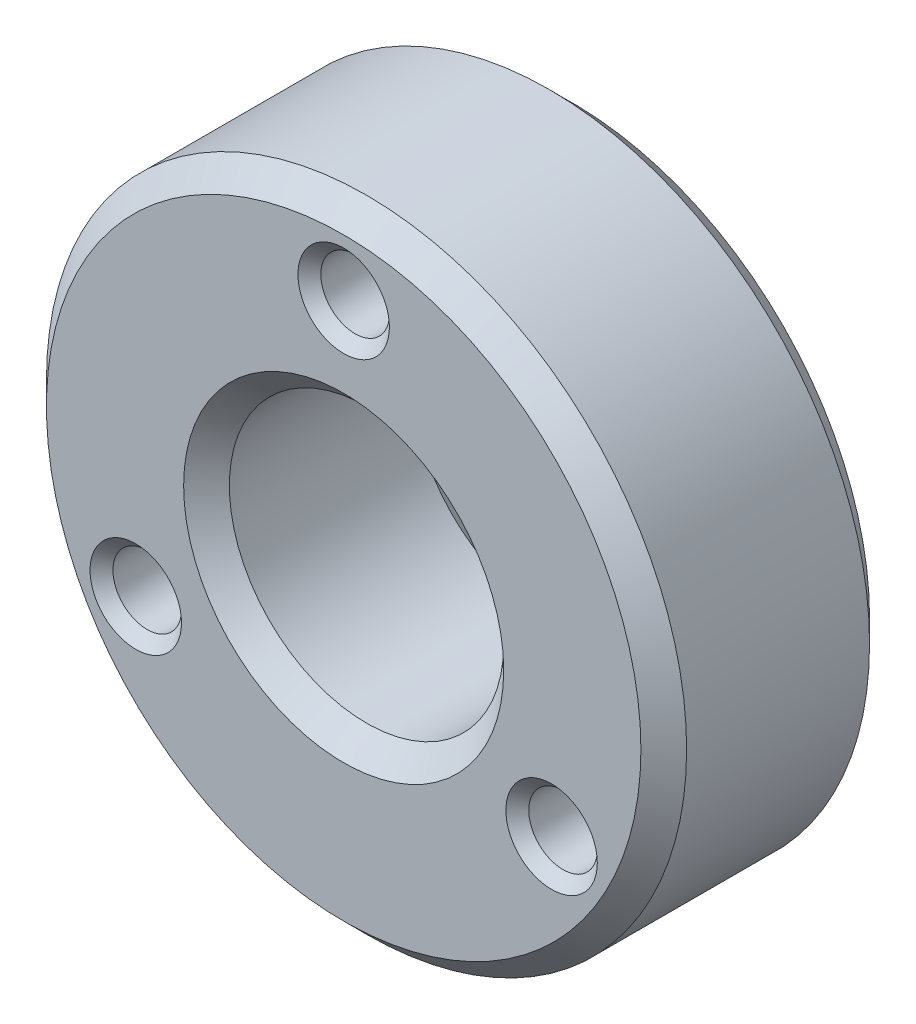
ISO-10303-21;
HEADER;
FILE_DESCRIPTION(('STEP AP214'),'2;1');
FILE_NAME('part.step','',(''),(''),'','','');
FILE_SCHEMA(('AUTOMOTIVE_DESIGN { 1 0 10303 214 1 1 1 1 }'));
ENDSEC;
DATA;
#1=APPLICATION_CONTEXT('core data for automotive mechanical design processes');
#2=APPLICATION_PROTOCOL_DEFINITION('international standard','automotive_design',2000,#1);
#3=PRODUCT_CONTEXT('',#1,'mechanical');
#4=PRODUCT('Part','Part','',(#3));
#5=PRODUCT_RELATED_PRODUCT_CATEGORY('part','',(#4));
#6=PRODUCT_DEFINITION_FORMATION('','',#4);
#7=PRODUCT_DEFINITION_CONTEXT('part definition',#1,'design');
#8=PRODUCT_DEFINITION('design','',#6,#7);
#9=PRODUCT_DEFINITION_SHAPE('','',#8);
#10=(LENGTH_UNIT() NAMED_UNIT(*) SI_UNIT(.MILLI.,.METRE.));
#11=(NAMED_UNIT(*) PLANE_ANGLE_UNIT() SI_UNIT($,.RADIAN.));
#12=(NAMED_UNIT(*) SI_UNIT($,.STERADIAN.) SOLID_ANGLE_UNIT());
#13=UNCERTAINTY_MEASURE_WITH_UNIT(LENGTH_MEASURE(1.E-05),#10,'distance_accuracy_value','');
#14=(GEOMETRIC_REPRESENTATION_CONTEXT(3) GLOBAL_UNCERTAINTY_ASSIGNED_CONTEXT((#13)) GLOBAL_UNIT_ASSIGNED_CONTEXT((#10,
#11,#12)) REPRESENTATION_CONTEXT('',''));
#15=CARTESIAN_POINT('',(0.,0.,0.));
#16=DIRECTION('',(0.,0.,1.));
#17=DIRECTION('',(1.,0.,0.));
#18=AXIS2_PLACEMENT_3D('',#15,#16,#17);
#19=CARTESIAN_POINT('',(0.,0.,10.));
#20=DIRECTION('',(0.,0.,1.));
#21=DIRECTION('',(1.,0.,0.));
#22=AXIS2_PLACEMENT_3D('',#19,#20,#21);
#23=PLANE('',#22);
#24=CARTESIAN_POINT('',(9.0932667397366,-5.25,10.));
#25=DIRECTION('',(0.,0.,1.));
#26=DIRECTION('',(1.,0.,0.));
#27=AXIS2_PLACEMENT_3D('',#24,#25,#26);
#28=CIRCLE('',#27,2.);
#29=CARTESIAN_POINT('',(11.0932667397366,-5.25,10.));
#30=VERTEX_POINT('',#29);
#31=EDGE_CURVE('E10',#30,#30,#28,.F.);
#32=ORIENTED_EDGE('',*,*,#31,.T.);
#33=EDGE_LOOP('',(#32));
#34=FACE_BOUND('',#33,.T.);
#35=CARTESIAN_POINT('',(-9.09326673973661,-5.25,10.));
#36=DIRECTION('',(0.,0.,1.));
#37=DIRECTION('',(1.,0.,0.));
#38=AXIS2_PLACEMENT_3D('',#35,#36,#37);
#39=CIRCLE('',#38,2.00000000000001);
#40=CARTESIAN_POINT('',(-7.0932667397366,-5.25,10.));
#41=VERTEX_POINT('',#40);
#42=EDGE_CURVE('E48',#41,#41,#39,.F.);
#43=ORIENTED_EDGE('',*,*,#42,.T.);
#44=EDGE_LOOP('',(#43));
#45=FACE_BOUND('',#44,.T.);
#46=CARTESIAN_POINT('',(0.,10.5,10.));
#47=DIRECTION('',(0.,0.,1.));
#48=DIRECTION('',(1.,0.,0.));
#49=AXIS2_PLACEMENT_3D('',#46,#47,#48);
#50=CIRCLE('',#49,2.00000000000001);
#51=CARTESIAN_POINT('',(2.00000000000001,10.5,10.));
#52=VERTEX_POINT('',#51);
#53=EDGE_CURVE('E53',#52,#52,#50,.F.);
#54=ORIENTED_EDGE('',*,*,#53,.T.);
#55=EDGE_LOOP('',(#54));
#56=FACE_BOUND('',#55,.T.);
#57=CARTESIAN_POINT('',(0.,0.,10.));
#58=DIRECTION('',(0.,0.,1.));
#59=DIRECTION('',(1.,0.,0.));
#60=AXIS2_PLACEMENT_3D('',#57,#58,#59);
#61=CIRCLE('',#60,7.00000000000001);
#62=CARTESIAN_POINT('',(7.00000000000001,0.,10.));
#63=VERTEX_POINT('',#62);
#64=EDGE_CURVE('E104',#63,#63,#61,.F.);
#65=ORIENTED_EDGE('',*,*,#64,.T.);
#66=EDGE_LOOP('',(#65));
#67=FACE_BOUND('',#66,.T.);
#68=CARTESIAN_POINT('',(0.,0.,10.));
#69=DIRECTION('',(0.,0.,1.));
#70=DIRECTION('',(1.,0.,0.));
#71=AXIS2_PLACEMENT_3D('',#68,#69,#70);
#72=CIRCLE('',#71,13.);
#73=CARTESIAN_POINT('',(13.,0.,10.));
#74=VERTEX_POINT('',#73);
#75=EDGE_CURVE('E108',#74,#74,#72,.T.);
#76=ORIENTED_EDGE('',*,*,#75,.T.);
#77=EDGE_LOOP('',(#76));
#78=FACE_BOUND('',#77,.T.);
#79=ADVANCED_FACE('F39',(#34,#45,#56,#67,#78),#23,.T.);
#80=CARTESIAN_POINT('',(0.,0.,0.));
#81=DIRECTION('',(0.,0.,1.));
#82=DIRECTION('',(1.,0.,0.));
#83=AXIS2_PLACEMENT_3D('',#80,#81,#82);
#84=PLANE('',#83);
#85=CARTESIAN_POINT('',(-9.09326673973661,-5.25,0.));
#86=DIRECTION('',(0.,0.,1.));
#87=DIRECTION('',(1.,0.,0.));
#88=AXIS2_PLACEMENT_3D('',#85,#86,#87);
#89=CIRCLE('',#88,2.);
#90=CARTESIAN_POINT('',(-7.09326673973661,-5.25,0.));
#91=VERTEX_POINT('',#90);
#92=EDGE_CURVE('E84',#91,#91,#89,.T.);
#93=ORIENTED_EDGE('',*,*,#92,.T.);
#94=EDGE_LOOP('',(#93));
#95=FACE_BOUND('',#94,.T.);
#96=CARTESIAN_POINT('',(9.0932667397366,-5.25,0.));
#97=DIRECTION('',(0.,0.,1.));
#98=DIRECTION('',(1.,0.,0.));
#99=AXIS2_PLACEMENT_3D('',#96,#97,#98);
#100=CIRCLE('',#99,2.);
#101=CARTESIAN_POINT('',(11.0932667397366,-5.25,0.));
#102=VERTEX_POINT('',#101);
#103=EDGE_CURVE('E88',#102,#102,#100,.T.);
#104=ORIENTED_EDGE('',*,*,#103,.T.);
#105=EDGE_LOOP('',(#104));
#106=FACE_BOUND('',#105,.T.);
#107=CARTESIAN_POINT('',(0.,10.5,0.));
#108=DIRECTION('',(0.,0.,1.));
#109=DIRECTION('',(1.,0.,0.));
#110=AXIS2_PLACEMENT_3D('',#107,#108,#109);
#111=CIRCLE('',#110,2.);
#112=CARTESIAN_POINT('',(2.,10.5,0.));
#113=VERTEX_POINT('',#112);
#114=EDGE_CURVE('E92',#113,#113,#111,.T.);
#115=ORIENTED_EDGE('',*,*,#114,.T.);
#116=EDGE_LOOP('',(#115));
#117=FACE_BOUND('',#116,.T.);
#118=CARTESIAN_POINT('',(0.,0.,0.));
#119=DIRECTION('',(0.,0.,1.));
#120=DIRECTION('',(1.,0.,0.));
#121=AXIS2_PLACEMENT_3D('',#118,#119,#120);
#122=CIRCLE('',#121,7.00000000000001);
#123=CARTESIAN_POINT('',(7.00000000000001,0.,0.));
#124=VERTEX_POINT('',#123);
#125=EDGE_CURVE('E120',#124,#124,#122,.T.);
#126=ORIENTED_EDGE('',*,*,#125,.T.);
#127=EDGE_LOOP('',(#126));
#128=FACE_BOUND('',#127,.T.);
#129=CARTESIAN_POINT('',(0.,0.,0.));
#130=DIRECTION('',(0.,0.,1.));
#131=DIRECTION('',(1.,0.,0.));
#132=AXIS2_PLACEMENT_3D('',#129,#130,#131);
#133=CIRCLE('',#132,13.);
#134=CARTESIAN_POINT('',(13.,0.,0.));
#135=VERTEX_POINT('',#134);
#136=EDGE_CURVE('E124',#135,#135,#133,.F.);
#137=ORIENTED_EDGE('',*,*,#136,.T.);
#138=EDGE_LOOP('',(#137));
#139=FACE_BOUND('',#138,.T.);
#140=ADVANCED_FACE('F129',(#95,#106,#117,#128,#139),#84,.F.);
#141=CARTESIAN_POINT('',(0.,0.,10.));
#142=DIRECTION('',(0.,0.,-1.));
#143=DIRECTION('',(-1.,0.,0.));
#144=AXIS2_PLACEMENT_3D('',#141,#142,#143);
#145=CYLINDRICAL_SURFACE('',#144,14.);
#146=CARTESIAN_POINT('',(0.,0.,9.00000000000001));
#147=DIRECTION('',(0.,0.,1.));
#148=DIRECTION('',(1.,0.,0.));
#149=AXIS2_PLACEMENT_3D('',#146,#147,#148);
#150=CIRCLE('',#149,14.);
#151=CARTESIAN_POINT('',(14.,0.,9.00000000000001));
#152=VERTEX_POINT('',#151);
#153=EDGE_CURVE('E96',#152,#152,#150,.F.);
#154=ORIENTED_EDGE('',*,*,#153,.T.);
#155=EDGE_LOOP('',(#154));
#156=FACE_BOUND('',#155,.T.);
#157=CARTESIAN_POINT('',(0.,0.,1.));
#158=DIRECTION('',(0.,0.,1.));
#159=DIRECTION('',(1.,0.,0.));
#160=AXIS2_PLACEMENT_3D('',#157,#158,#159);
#161=CIRCLE('',#160,14.);
#162=CARTESIAN_POINT('',(14.,0.,1.));
#163=VERTEX_POINT('',#162);
#164=EDGE_CURVE('E100',#163,#163,#161,.T.);
#165=ORIENTED_EDGE('',*,*,#164,.T.);
#166=EDGE_LOOP('',(#165));
#167=FACE_BOUND('',#166,.T.);
#168=ADVANCED_FACE('F139',(#156,#167),#145,.T.);
#169=CARTESIAN_POINT('',(0.,0.,10.));
#170=DIRECTION('',(0.,0.,-1.));
#171=DIRECTION('',(-1.,0.,0.));
#172=AXIS2_PLACEMENT_3D('',#169,#170,#171);
#173=CYLINDRICAL_SURFACE('',#172,6.);
#174=CARTESIAN_POINT('',(0.,0.,1.00000000000001));
#175=DIRECTION('',(0.,0.,1.));
#176=DIRECTION('',(1.,0.,0.));
#177=AXIS2_PLACEMENT_3D('',#174,#175,#176);
#178=CIRCLE('',#177,6.);
#179=CARTESIAN_POINT('',(6.,0.,1.00000000000001));
#180=VERTEX_POINT('',#179);
#181=EDGE_CURVE('E112',#180,#180,#178,.F.);
#182=ORIENTED_EDGE('',*,*,#181,.T.);
#183=EDGE_LOOP('',(#182));
#184=FACE_BOUND('',#183,.T.);
#185=CARTESIAN_POINT('',(0.,0.,8.99999999999999));
#186=DIRECTION('',(0.,0.,1.));
#187=DIRECTION('',(1.,0.,0.));
#188=AXIS2_PLACEMENT_3D('',#185,#186,#187);
#189=CIRCLE('',#188,6.);
#190=CARTESIAN_POINT('',(6.,0.,8.99999999999999));
#191=VERTEX_POINT('',#190);
#192=EDGE_CURVE('E116',#191,#191,#189,.T.);
#193=ORIENTED_EDGE('',*,*,#192,.T.);
#194=EDGE_LOOP('',(#193));
#195=FACE_BOUND('',#194,.T.);
#196=ADVANCED_FACE('F141',(#184,#195),#173,.F.);
#197=CARTESIAN_POINT('',(0.,10.5,10.));
#198=DIRECTION('',(0.,0.,-1.));
#199=DIRECTION('',(-1.,0.,0.));
#200=AXIS2_PLACEMENT_3D('',#197,#198,#199);
#201=CYLINDRICAL_SURFACE('',#200,1.5);
#202=CARTESIAN_POINT('',(0.,10.5,0.5));
#203=DIRECTION('',(0.,0.,1.));
#204=DIRECTION('',(1.,0.,0.));
#205=AXIS2_PLACEMENT_3D('',#202,#203,#204);
#206=CIRCLE('',#205,1.5);
#207=CARTESIAN_POINT('',(1.5,10.5,0.5));
#208=VERTEX_POINT('',#207);
#209=EDGE_CURVE('E58',#208,#208,#206,.F.);
#210=ORIENTED_EDGE('',*,*,#209,.T.);
#211=EDGE_LOOP('',(#210));
#212=FACE_BOUND('',#211,.T.);
#213=CARTESIAN_POINT('',(0.,10.5,9.49999999999999));
#214=DIRECTION('',(0.,0.,1.));
#215=DIRECTION('',(1.,0.,0.));
#216=AXIS2_PLACEMENT_3D('',#213,#214,#215);
#217=CIRCLE('',#216,1.5);
#218=CARTESIAN_POINT('',(1.5,10.5,9.49999999999999));
#219=VERTEX_POINT('',#218);
#220=EDGE_CURVE('E64',#219,#219,#217,.T.);
#221=ORIENTED_EDGE('',*,*,#220,.T.);
#222=EDGE_LOOP('',(#221));
#223=FACE_BOUND('',#222,.T.);
#224=ADVANCED_FACE('F148',(#212,#223),#201,.F.);
#225=CARTESIAN_POINT('',(9.0932667397366,-5.25,10.));
#226=DIRECTION('',(0.,0.,-1.));
#227=DIRECTION('',(-1.,0.,0.));
#228=AXIS2_PLACEMENT_3D('',#225,#226,#227);
#229=CYLINDRICAL_SURFACE('',#228,1.5);
#230=CARTESIAN_POINT('',(9.0932667397366,-5.25,0.500000000000007));
#231=DIRECTION('',(0.,0.,1.));
#232=DIRECTION('',(1.,0.,0.));
#233=AXIS2_PLACEMENT_3D('',#230,#231,#232);
#234=CIRCLE('',#233,1.5);
#235=CARTESIAN_POINT('',(10.5932667397366,-5.25,0.500000000000007));
#236=VERTEX_POINT('',#235);
#237=EDGE_CURVE('E68',#236,#236,#234,.F.);
#238=ORIENTED_EDGE('',*,*,#237,.T.);
#239=EDGE_LOOP('',(#238));
#240=FACE_BOUND('',#239,.T.);
#241=CARTESIAN_POINT('',(9.0932667397366,-5.25,9.5));
#242=DIRECTION('',(0.,0.,1.));
#243=DIRECTION('',(1.,0.,0.));
#244=AXIS2_PLACEMENT_3D('',#241,#242,#243);
#245=CIRCLE('',#244,1.5);
#246=CARTESIAN_POINT('',(10.5932667397366,-5.25,9.5));
#247=VERTEX_POINT('',#246);
#248=EDGE_CURVE('E72',#247,#247,#245,.T.);
#249=ORIENTED_EDGE('',*,*,#248,.T.);
#250=EDGE_LOOP('',(#249));
#251=FACE_BOUND('',#250,.T.);
#252=ADVANCED_FACE('F161',(#240,#251),#229,.F.);
#253=CARTESIAN_POINT('',(-9.09326673973661,-5.25,10.));
#254=DIRECTION('',(0.,0.,-1.));
#255=DIRECTION('',(-1.,0.,0.));
#256=AXIS2_PLACEMENT_3D('',#253,#254,#255);
#257=CYLINDRICAL_SURFACE('',#256,1.5);
#258=CARTESIAN_POINT('',(-9.09326673973661,-5.25,0.499999999999999));
#259=DIRECTION('',(0.,0.,1.));
#260=DIRECTION('',(1.,0.,0.));
#261=AXIS2_PLACEMENT_3D('',#258,#259,#260);
#262=CIRCLE('',#261,1.5);
#263=CARTESIAN_POINT('',(-7.59326673973661,-5.25,0.499999999999999));
#264=VERTEX_POINT('',#263);
#265=EDGE_CURVE('E76',#264,#264,#262,.F.);
#266=ORIENTED_EDGE('',*,*,#265,.T.);
#267=EDGE_LOOP('',(#266));
#268=FACE_BOUND('',#267,.T.);
#269=CARTESIAN_POINT('',(-9.09326673973661,-5.25,9.49999999999999));
#270=DIRECTION('',(0.,0.,1.));
#271=DIRECTION('',(1.,0.,0.));
#272=AXIS2_PLACEMENT_3D('',#269,#270,#271);
#273=CIRCLE('',#272,1.5);
#274=CARTESIAN_POINT('',(-7.59326673973661,-5.25,9.49999999999999));
#275=VERTEX_POINT('',#274);
#276=EDGE_CURVE('E80',#275,#275,#273,.T.);
#277=ORIENTED_EDGE('',*,*,#276,.T.);
#278=EDGE_LOOP('',(#277));
#279=FACE_BOUND('',#278,.T.);
#280=ADVANCED_FACE('F165',(#268,#279),#257,.F.);
#281=CARTESIAN_POINT('',(0.,0.,0.));
#282=DIRECTION('',(0.,0.,-1.));
#283=DIRECTION('',(-1.,0.,0.));
#284=AXIS2_PLACEMENT_3D('',#281,#282,#283);
#285=CONICAL_SURFACE('',#284,7.00000000000001,0.785398163397447);
#286=ORIENTED_EDGE('',*,*,#181,.F.);
#287=EDGE_LOOP('',(#286));
#288=FACE_BOUND('',#287,.T.);
#289=ORIENTED_EDGE('',*,*,#125,.F.);
#290=EDGE_LOOP('',(#289));
#291=FACE_BOUND('',#290,.T.);
#292=ADVANCED_FACE('F168',(#288,#291),#285,.F.);
#293=CARTESIAN_POINT('',(0.,0.,8.99999999999999));
#294=DIRECTION('',(0.,0.,1.));
#295=DIRECTION('',(1.,0.,0.));
#296=AXIS2_PLACEMENT_3D('',#293,#294,#295);
#297=CONICAL_SURFACE('',#296,6.,0.785398163397452);
#298=ORIENTED_EDGE('',*,*,#64,.F.);
#299=EDGE_LOOP('',(#298));
#300=FACE_BOUND('',#299,.T.);
#301=ORIENTED_EDGE('',*,*,#192,.F.);
#302=EDGE_LOOP('',(#301));
#303=FACE_BOUND('',#302,.T.);
#304=ADVANCED_FACE('F173',(#300,#303),#297,.F.);
#305=CARTESIAN_POINT('',(0.,0.,10.));
#306=DIRECTION('',(0.,0.,-1.));
#307=DIRECTION('',(-1.,0.,0.));
#308=AXIS2_PLACEMENT_3D('',#305,#306,#307);
#309=CONICAL_SURFACE('',#308,13.,0.785398163397447);
#310=ORIENTED_EDGE('',*,*,#153,.F.);
#311=EDGE_LOOP('',(#310));
#312=FACE_BOUND('',#311,.T.);
#313=ORIENTED_EDGE('',*,*,#75,.F.);
#314=EDGE_LOOP('',(#313));
#315=FACE_BOUND('',#314,.T.);
#316=ADVANCED_FACE('F135',(#312,#315),#309,.T.);
#317=CARTESIAN_POINT('',(0.,0.,1.));
#318=DIRECTION('',(0.,0.,1.));
#319=DIRECTION('',(1.,0.,0.));
#320=AXIS2_PLACEMENT_3D('',#317,#318,#319);
#321=CONICAL_SURFACE('',#320,14.,0.78539816339745);
#322=ORIENTED_EDGE('',*,*,#136,.F.);
#323=EDGE_LOOP('',(#322));
#324=FACE_BOUND('',#323,.T.);
#325=ORIENTED_EDGE('',*,*,#164,.F.);
#326=EDGE_LOOP('',(#325));
#327=FACE_BOUND('',#326,.T.);
#328=ADVANCED_FACE('F131',(#324,#327),#321,.T.);
#329=CARTESIAN_POINT('',(-9.09326673973661,-5.25,0.));
#330=DIRECTION('',(0.,0.,-1.));
#331=DIRECTION('',(-1.,0.,0.));
#332=AXIS2_PLACEMENT_3D('',#329,#330,#331);
#333=CONICAL_SURFACE('',#332,2.,0.785398163397449);
#334=ORIENTED_EDGE('',*,*,#265,.F.);
#335=EDGE_LOOP('',(#334));
#336=FACE_BOUND('',#335,.T.);
#337=ORIENTED_EDGE('',*,*,#92,.F.);
#338=EDGE_LOOP('',(#337));
#339=FACE_BOUND('',#338,.T.);
#340=ADVANCED_FACE('F134',(#336,#339),#333,.F.);
#341=CARTESIAN_POINT('',(9.0932667397366,-5.25,0.));
#342=DIRECTION('',(0.,0.,-1.));
#343=DIRECTION('',(-1.,0.,0.));
#344=AXIS2_PLACEMENT_3D('',#341,#342,#343);
#345=CONICAL_SURFACE('',#344,2.,0.785398163397444);
#346=ORIENTED_EDGE('',*,*,#237,.F.);
#347=EDGE_LOOP('',(#346));
#348=FACE_BOUND('',#347,.T.);
#349=ORIENTED_EDGE('',*,*,#103,.F.);
#350=EDGE_LOOP('',(#349));
#351=FACE_BOUND('',#350,.T.);
#352=ADVANCED_FACE('F204',(#348,#351),#345,.F.);
#353=CARTESIAN_POINT('',(0.,10.5,0.));
#354=DIRECTION('',(0.,0.,-1.));
#355=DIRECTION('',(-1.,0.,0.));
#356=AXIS2_PLACEMENT_3D('',#353,#354,#355);
#357=CONICAL_SURFACE('',#356,2.,0.78539816339745);
#358=ORIENTED_EDGE('',*,*,#209,.F.);
#359=EDGE_LOOP('',(#358));
#360=FACE_BOUND('',#359,.T.);
#361=ORIENTED_EDGE('',*,*,#114,.F.);
#362=EDGE_LOOP('',(#361));
#363=FACE_BOUND('',#362,.T.);
#364=ADVANCED_FACE('F188',(#360,#363),#357,.F.);
#365=CARTESIAN_POINT('',(9.0932667397366,-5.25,9.5));
#366=DIRECTION('',(0.,0.,1.));
#367=DIRECTION('',(1.,0.,0.));
#368=AXIS2_PLACEMENT_3D('',#365,#366,#367);
#369=CONICAL_SURFACE('',#368,1.5,0.785398163397451);
#370=ORIENTED_EDGE('',*,*,#31,.F.);
#371=EDGE_LOOP('',(#370));
#372=FACE_BOUND('',#371,.T.);
#373=ORIENTED_EDGE('',*,*,#248,.F.);
#374=EDGE_LOOP('',(#373));
#375=FACE_BOUND('',#374,.T.);
#376=ADVANCED_FACE('F181',(#372,#375),#369,.F.);
#377=CARTESIAN_POINT('',(-9.09326673973661,-5.25,9.49999999999999));
#378=DIRECTION('',(0.,0.,1.));
#379=DIRECTION('',(1.,0.,0.));
#380=AXIS2_PLACEMENT_3D('',#377,#378,#379);
#381=CONICAL_SURFACE('',#380,1.5,0.785398163397449);
#382=ORIENTED_EDGE('',*,*,#42,.F.);
#383=EDGE_LOOP('',(#382));
#384=FACE_BOUND('',#383,.T.);
#385=ORIENTED_EDGE('',*,*,#276,.F.);
#386=EDGE_LOOP('',(#385));
#387=FACE_BOUND('',#386,.T.);
#388=ADVANCED_FACE('F179',(#384,#387),#381,.F.);
#389=CARTESIAN_POINT('',(0.,10.5,9.49999999999999));
#390=DIRECTION('',(0.,0.,1.));
#391=DIRECTION('',(1.,0.,0.));
#392=AXIS2_PLACEMENT_3D('',#389,#390,#391);
#393=CONICAL_SURFACE('',#392,1.5,0.78539816339745);
#394=ORIENTED_EDGE('',*,*,#53,.F.);
#395=EDGE_LOOP('',(#394));
#396=FACE_BOUND('',#395,.T.);
#397=ORIENTED_EDGE('',*,*,#220,.F.);
#398=EDGE_LOOP('',(#397));
#399=FACE_BOUND('',#398,.T.);
#400=ADVANCED_FACE('F42',(#396,#399),#393,.F.);
#401=CLOSED_SHELL('',(#79,#140,#168,#196,#224,#252,#280,#292,#304,#316,#328,#340,#352,#364,#376,
#388,#400));
#402=MANIFOLD_SOLID_BREP('B2',#401);
#403=ADVANCED_BREP_SHAPE_REPRESENTATION('',(#18,#402),#14);
#404=SHAPE_DEFINITION_REPRESENTATION(#9,#403);
ENDSEC;
END-ISO-10303-21;
